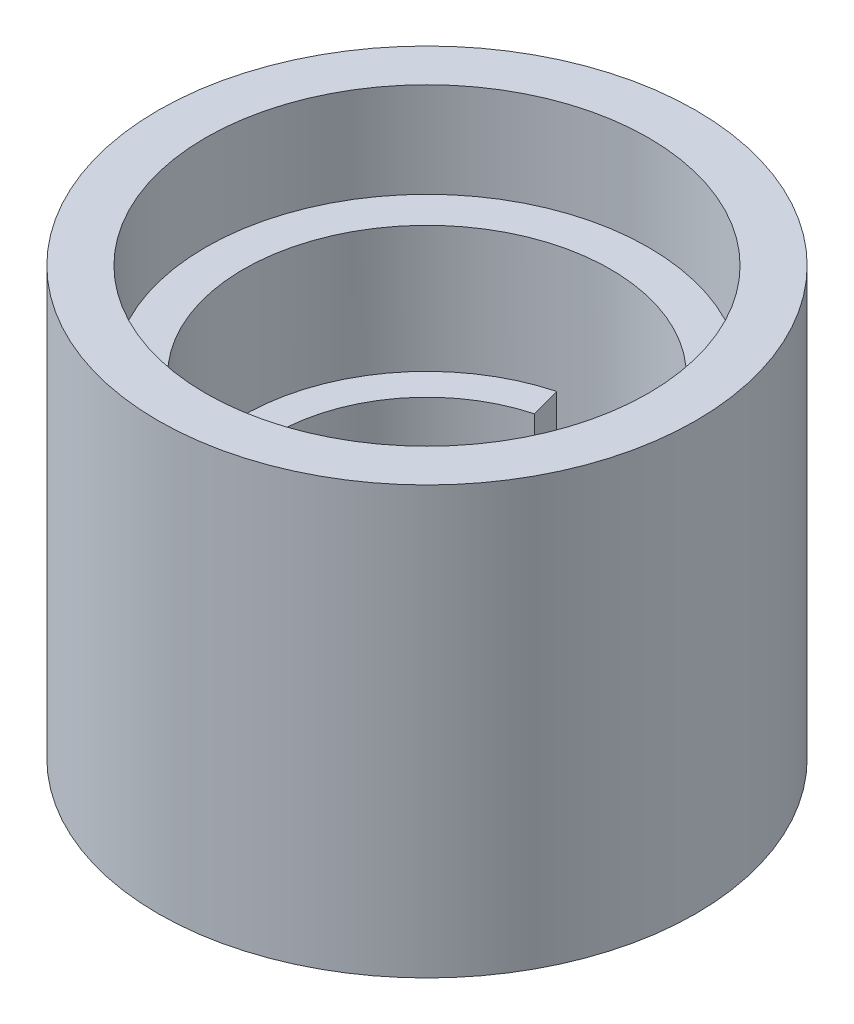
ISO-10303-21;
HEADER;
FILE_DESCRIPTION(('STEP AP214'),'2;1');
FILE_NAME('part.step','',(''),(''),'','','');
FILE_SCHEMA(('AUTOMOTIVE_DESIGN { 1 0 10303 214 1 1 1 1 }'));
ENDSEC;
DATA;
#1=APPLICATION_CONTEXT('core data for automotive mechanical design processes');
#2=APPLICATION_PROTOCOL_DEFINITION('international standard','automotive_design',2000,#1);
#3=PRODUCT_CONTEXT('',#1,'mechanical');
#4=PRODUCT('Part','Part','',(#3));
#5=PRODUCT_RELATED_PRODUCT_CATEGORY('part','',(#4));
#6=PRODUCT_DEFINITION_FORMATION('','',#4);
#7=PRODUCT_DEFINITION_CONTEXT('part definition',#1,'design');
#8=PRODUCT_DEFINITION('design','',#6,#7);
#9=PRODUCT_DEFINITION_SHAPE('','',#8);
#10=(LENGTH_UNIT() NAMED_UNIT(*) SI_UNIT(.MILLI.,.METRE.));
#11=(NAMED_UNIT(*) PLANE_ANGLE_UNIT() SI_UNIT($,.RADIAN.));
#12=(NAMED_UNIT(*) SI_UNIT($,.STERADIAN.) SOLID_ANGLE_UNIT());
#13=UNCERTAINTY_MEASURE_WITH_UNIT(LENGTH_MEASURE(1.E-05),#10,'distance_accuracy_value','');
#14=(GEOMETRIC_REPRESENTATION_CONTEXT(3) GLOBAL_UNCERTAINTY_ASSIGNED_CONTEXT((#13)) GLOBAL_UNIT_ASSIGNED_CONTEXT((#10,
#11,#12)) REPRESENTATION_CONTEXT('',''));
#15=CARTESIAN_POINT('',(0.,0.,0.));
#16=DIRECTION('',(0.,0.,1.));
#17=DIRECTION('',(1.,0.,0.));
#18=AXIS2_PLACEMENT_3D('',#15,#16,#17);
#19=CARTESIAN_POINT('',(0.,17.145,0.));
#20=DIRECTION('',(0.,-1.,0.));
#21=DIRECTION('',(0.,0.,-1.));
#22=AXIS2_PLACEMENT_3D('',#19,#20,#21);
#23=CYLINDRICAL_SURFACE('',#22,6.096);
#24=DIRECTION('',(0.,-1.,0.));
#25=VECTOR('',#24,1.);
#26=CARTESIAN_POINT('',(1.57776089894497,17.145,-5.88828383705816));
#27=LINE('',#26,#25);
#28=CARTESIAN_POINT('',(1.57776089894497,0.,-5.88828383705816));
#29=VERTEX_POINT('',#28);
#30=CARTESIAN_POINT('',(1.57776089894497,8.255,-5.88828383705816));
#31=VERTEX_POINT('',#30);
#32=EDGE_CURVE('E57',#29,#31,#27,.F.);
#33=ORIENTED_EDGE('',*,*,#32,.F.);
#34=CARTESIAN_POINT('',(0.,0.,0.));
#35=DIRECTION('',(0.,1.,0.));
#36=DIRECTION('',(0.,0.,1.));
#37=AXIS2_PLACEMENT_3D('',#34,#35,#36);
#38=CIRCLE('',#37,6.096);
#39=CARTESIAN_POINT('',(-1.57776089894497,0.,-5.88828383705816));
#40=VERTEX_POINT('',#39);
#41=EDGE_CURVE('E105',#40,#29,#38,.T.);
#42=ORIENTED_EDGE('',*,*,#41,.F.);
#43=DIRECTION('',(0.,-1.,0.));
#44=VECTOR('',#43,1.);
#45=CARTESIAN_POINT('',(-1.57776089894497,17.145,-5.88828383705816));
#46=LINE('',#45,#44);
#47=CARTESIAN_POINT('',(-1.57776089894497,8.255,-5.88828383705816));
#48=VERTEX_POINT('',#47);
#49=EDGE_CURVE('E141',#48,#40,#46,.T.);
#50=ORIENTED_EDGE('',*,*,#49,.F.);
#51=CARTESIAN_POINT('',(0.,8.255,0.));
#52=DIRECTION('',(0.,1.,0.));
#53=DIRECTION('',(0.,0.,1.));
#54=AXIS2_PLACEMENT_3D('',#51,#52,#53);
#55=CIRCLE('',#54,6.096);
#56=EDGE_CURVE('E99',#48,#31,#55,.T.);
#57=ORIENTED_EDGE('',*,*,#56,.T.);
#58=EDGE_LOOP('',(#33,#42,#50,#57));
#59=FACE_BOUND('',#58,.T.);
#60=ADVANCED_FACE('F36',(#59),#23,.F.);
#61=CARTESIAN_POINT('',(0.,17.145,0.));
#62=DIRECTION('',(0.,-1.,0.));
#63=DIRECTION('',(0.,0.,-1.));
#64=AXIS2_PLACEMENT_3D('',#61,#62,#63);
#65=CYLINDRICAL_SURFACE('',#64,10.795);
#66=CARTESIAN_POINT('',(0.,17.145,0.));
#67=DIRECTION('',(0.,1.,0.));
#68=DIRECTION('',(0.,0.,1.));
#69=AXIS2_PLACEMENT_3D('',#66,#67,#68);
#70=CIRCLE('',#69,10.795);
#71=CARTESIAN_POINT('',(0.,17.145,10.795));
#72=VERTEX_POINT('',#71);
#73=EDGE_CURVE('E43',#72,#72,#70,.T.);
#74=ORIENTED_EDGE('',*,*,#73,.F.);
#75=EDGE_LOOP('',(#74));
#76=FACE_BOUND('',#75,.T.);
#77=CARTESIAN_POINT('',(0.,0.,0.));
#78=DIRECTION('',(0.,1.,0.));
#79=DIRECTION('',(0.,0.,1.));
#80=AXIS2_PLACEMENT_3D('',#77,#78,#79);
#81=CIRCLE('',#80,10.795);
#82=CARTESIAN_POINT('',(0.,0.,10.795));
#83=VERTEX_POINT('',#82);
#84=EDGE_CURVE('E109',#83,#83,#81,.T.);
#85=ORIENTED_EDGE('',*,*,#84,.T.);
#86=EDGE_LOOP('',(#85));
#87=FACE_BOUND('',#86,.T.);
#88=ADVANCED_FACE('F114',(#76,#87),#65,.T.);
#89=CARTESIAN_POINT('',(0.,17.145,0.));
#90=DIRECTION('',(0.,1.,0.));
#91=DIRECTION('',(0.,0.,1.));
#92=AXIS2_PLACEMENT_3D('',#89,#90,#91);
#93=PLANE('',#92);
#94=CARTESIAN_POINT('',(0.,17.145,0.));
#95=DIRECTION('',(0.,1.,0.));
#96=DIRECTION('',(0.,0.,1.));
#97=AXIS2_PLACEMENT_3D('',#94,#95,#96);
#98=CIRCLE('',#97,8.89);
#99=CARTESIAN_POINT('',(0.,17.145,8.89));
#100=VERTEX_POINT('',#99);
#101=EDGE_CURVE('E92',#100,#100,#98,.T.);
#102=ORIENTED_EDGE('',*,*,#101,.F.);
#103=EDGE_LOOP('',(#102));
#104=FACE_BOUND('',#103,.T.);
#105=ORIENTED_EDGE('',*,*,#73,.T.);
#106=EDGE_LOOP('',(#105));
#107=FACE_BOUND('',#106,.T.);
#108=ADVANCED_FACE('F119',(#104,#107),#93,.T.);
#109=CARTESIAN_POINT('',(0.,0.,0.));
#110=DIRECTION('',(0.,1.,0.));
#111=DIRECTION('',(0.,0.,1.));
#112=AXIS2_PLACEMENT_3D('',#109,#110,#111);
#113=PLANE('',#112);
#114=ORIENTED_EDGE('',*,*,#41,.T.);
#115=DIRECTION('',(-0.258819045102521,0.,0.965925826289068));
#116=VECTOR('',#115,1.);
#117=CARTESIAN_POINT('',(0.,0.,0.));
#118=LINE('',#117,#116);
#119=CARTESIAN_POINT('',(1.90646108622517,0.,-7.11500963644528));
#120=VERTEX_POINT('',#119);
#121=EDGE_CURVE('E88',#120,#29,#118,.T.);
#122=ORIENTED_EDGE('',*,*,#121,.F.);
#123=CARTESIAN_POINT('',(0.,0.,0.));
#124=DIRECTION('',(0.,1.,0.));
#125=DIRECTION('',(0.,0.,1.));
#126=AXIS2_PLACEMENT_3D('',#123,#124,#125);
#127=CIRCLE('',#126,7.366);
#128=CARTESIAN_POINT('',(-1.90646108622517,0.,-7.11500963644528));
#129=VERTEX_POINT('',#128);
#130=EDGE_CURVE('E87',#129,#120,#127,.F.);
#131=ORIENTED_EDGE('',*,*,#130,.F.);
#132=DIRECTION('',(-0.258819045102522,0.,-0.965925826289068));
#133=VECTOR('',#132,1.);
#134=CARTESIAN_POINT('',(0.,0.,0.));
#135=LINE('',#134,#133);
#136=EDGE_CURVE('E143',#40,#129,#135,.T.);
#137=ORIENTED_EDGE('',*,*,#136,.F.);
#138=EDGE_LOOP('',(#114,#122,#131,#137));
#139=FACE_BOUND('',#138,.T.);
#140=ORIENTED_EDGE('',*,*,#84,.F.);
#141=EDGE_LOOP('',(#140));
#142=FACE_BOUND('',#141,.T.);
#143=ADVANCED_FACE('F116',(#139,#142),#113,.F.);
#144=CARTESIAN_POINT('',(0.,13.335,0.));
#145=DIRECTION('',(0.,1.,0.));
#146=DIRECTION('',(0.,0.,1.));
#147=AXIS2_PLACEMENT_3D('',#144,#145,#146);
#148=CYLINDRICAL_SURFACE('',#147,8.89);
#149=CARTESIAN_POINT('',(0.,13.335,0.));
#150=DIRECTION('',(0.,1.,0.));
#151=DIRECTION('',(0.,0.,1.));
#152=AXIS2_PLACEMENT_3D('',#149,#150,#151);
#153=CIRCLE('',#152,8.89);
#154=CARTESIAN_POINT('',(0.,13.335,8.89));
#155=VERTEX_POINT('',#154);
#156=EDGE_CURVE('E96',#155,#155,#153,.T.);
#157=ORIENTED_EDGE('',*,*,#156,.F.);
#158=EDGE_LOOP('',(#157));
#159=FACE_BOUND('',#158,.T.);
#160=ORIENTED_EDGE('',*,*,#101,.T.);
#161=EDGE_LOOP('',(#160));
#162=FACE_BOUND('',#161,.T.);
#163=ADVANCED_FACE('F118',(#159,#162),#148,.F.);
#164=CARTESIAN_POINT('',(0.,13.335,0.));
#165=DIRECTION('',(0.,1.,0.));
#166=DIRECTION('',(0.,0.,1.));
#167=AXIS2_PLACEMENT_3D('',#164,#165,#166);
#168=PLANE('',#167);
#169=CARTESIAN_POINT('',(0.,13.335,0.));
#170=DIRECTION('',(0.,1.,0.));
#171=DIRECTION('',(0.,0.,1.));
#172=AXIS2_PLACEMENT_3D('',#169,#170,#171);
#173=CIRCLE('',#172,7.366);
#174=CARTESIAN_POINT('',(0.,13.335,7.366));
#175=VERTEX_POINT('',#174);
#176=EDGE_CURVE('E93',#175,#175,#173,.T.);
#177=ORIENTED_EDGE('',*,*,#176,.F.);
#178=EDGE_LOOP('',(#177));
#179=FACE_BOUND('',#178,.T.);
#180=ORIENTED_EDGE('',*,*,#156,.T.);
#181=EDGE_LOOP('',(#180));
#182=FACE_BOUND('',#181,.T.);
#183=ADVANCED_FACE('F127',(#179,#182),#168,.T.);
#184=CARTESIAN_POINT('',(0.,8.255,0.));
#185=DIRECTION('',(0.,1.,0.));
#186=DIRECTION('',(0.,0.,1.));
#187=AXIS2_PLACEMENT_3D('',#184,#185,#186);
#188=CYLINDRICAL_SURFACE('',#187,7.366);
#189=CARTESIAN_POINT('',(0.,8.255,0.));
#190=DIRECTION('',(0.,1.,0.));
#191=DIRECTION('',(0.,0.,1.));
#192=AXIS2_PLACEMENT_3D('',#189,#190,#191);
#193=CIRCLE('',#192,7.366);
#194=CARTESIAN_POINT('',(-1.90646108622517,8.255,-7.11500963644528));
#195=VERTEX_POINT('',#194);
#196=CARTESIAN_POINT('',(1.90646108622517,8.255,-7.11500963644528));
#197=VERTEX_POINT('',#196);
#198=EDGE_CURVE('E85',#195,#197,#193,.T.);
#199=ORIENTED_EDGE('',*,*,#198,.F.);
#200=DIRECTION('',(0.,1.,0.));
#201=VECTOR('',#200,1.);
#202=CARTESIAN_POINT('',(-1.90646108622517,-8.2943553994969,-7.11500963644528));
#203=LINE('',#202,#201);
#204=EDGE_CURVE('E50',#129,#195,#203,.T.);
#205=ORIENTED_EDGE('',*,*,#204,.F.);
#206=ORIENTED_EDGE('',*,*,#130,.T.);
#207=DIRECTION('',(0.,1.,0.));
#208=VECTOR('',#207,1.);
#209=CARTESIAN_POINT('',(1.90646108622517,-8.2943553994969,-7.11500963644528));
#210=LINE('',#209,#208);
#211=EDGE_CURVE('E75',#120,#197,#210,.T.);
#212=ORIENTED_EDGE('',*,*,#211,.T.);
#213=EDGE_LOOP('',(#199,#205,#206,#212));
#214=FACE_BOUND('',#213,.T.);
#215=ORIENTED_EDGE('',*,*,#176,.T.);
#216=EDGE_LOOP('',(#215));
#217=FACE_BOUND('',#216,.T.);
#218=ADVANCED_FACE('F83',(#214,#217),#188,.F.);
#219=CARTESIAN_POINT('',(0.,8.255,0.));
#220=DIRECTION('',(0.,1.,0.));
#221=DIRECTION('',(0.,0.,1.));
#222=AXIS2_PLACEMENT_3D('',#219,#220,#221);
#223=PLANE('',#222);
#224=DIRECTION('',(0.258819045102521,0.,-0.965925826289068));
#225=VECTOR('',#224,1.);
#226=CARTESIAN_POINT('',(0.,8.255,0.));
#227=LINE('',#226,#225);
#228=EDGE_CURVE('E11',#31,#197,#227,.T.);
#229=ORIENTED_EDGE('',*,*,#228,.F.);
#230=ORIENTED_EDGE('',*,*,#56,.F.);
#231=DIRECTION('',(0.258819045102522,0.,0.965925826289068));
#232=VECTOR('',#231,1.);
#233=CARTESIAN_POINT('',(0.,8.255,0.));
#234=LINE('',#233,#232);
#235=EDGE_CURVE('E91',#195,#48,#234,.T.);
#236=ORIENTED_EDGE('',*,*,#235,.F.);
#237=ORIENTED_EDGE('',*,*,#198,.T.);
#238=EDGE_LOOP('',(#229,#230,#236,#237));
#239=FACE_BOUND('',#238,.T.);
#240=ADVANCED_FACE('F90',(#239),#223,.T.);
#241=CARTESIAN_POINT('',(0.,-8.2943553994969,0.));
#242=DIRECTION('',(0.965925826289068,0.,0.258819045102521));
#243=DIRECTION('',(0.258819045102521,0.,-0.965925826289068));
#244=AXIS2_PLACEMENT_3D('',#241,#242,#243);
#245=PLANE('',#244);
#246=ORIENTED_EDGE('',*,*,#32,.T.);
#247=ORIENTED_EDGE('',*,*,#228,.T.);
#248=ORIENTED_EDGE('',*,*,#211,.F.);
#249=ORIENTED_EDGE('',*,*,#121,.T.);
#250=EDGE_LOOP('',(#246,#247,#248,#249));
#251=FACE_BOUND('',#250,.T.);
#252=ADVANCED_FACE('F74',(#251),#245,.F.);
#253=CARTESIAN_POINT('',(0.,-8.2943553994969,0.));
#254=DIRECTION('',(-0.965925826289068,0.,0.258819045102522));
#255=DIRECTION('',(0.258819045102522,0.,0.965925826289068));
#256=AXIS2_PLACEMENT_3D('',#253,#254,#255);
#257=PLANE('',#256);
#258=ORIENTED_EDGE('',*,*,#49,.T.);
#259=ORIENTED_EDGE('',*,*,#136,.T.);
#260=ORIENTED_EDGE('',*,*,#204,.T.);
#261=ORIENTED_EDGE('',*,*,#235,.T.);
#262=EDGE_LOOP('',(#258,#259,#260,#261));
#263=FACE_BOUND('',#262,.T.);
#264=ADVANCED_FACE('F150',(#263),#257,.F.);
#265=CLOSED_SHELL('',(#60,#88,#108,#143,#163,#183,#218,#240,#252,#264));
#266=MANIFOLD_SOLID_BREP('B2',#265);
#267=ADVANCED_BREP_SHAPE_REPRESENTATION('',(#18,#266),#14);
#268=SHAPE_DEFINITION_REPRESENTATION(#9,#267);
ENDSEC;
END-ISO-10303-21;
